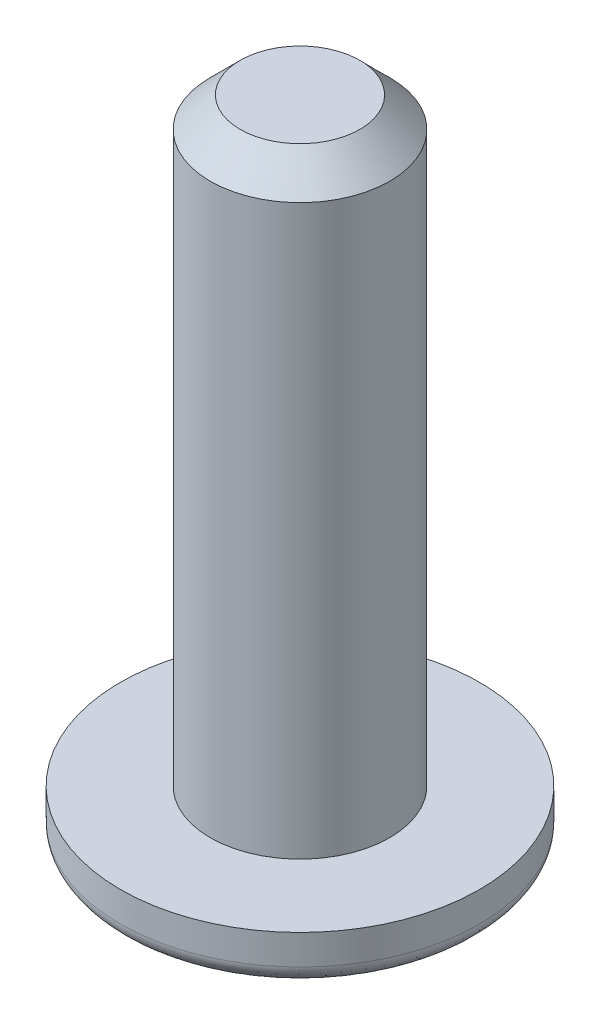
ISO-10303-21;
HEADER;
FILE_DESCRIPTION(('STEP AP214'),'2;1');
FILE_NAME('part.step','',(''),(''),'','','');
FILE_SCHEMA(('AUTOMOTIVE_DESIGN { 1 0 10303 214 1 1 1 1 }'));
ENDSEC;
DATA;
#1=APPLICATION_CONTEXT('core data for automotive mechanical design processes');
#2=APPLICATION_PROTOCOL_DEFINITION('international standard','automotive_design',2000,#1);
#3=PRODUCT_CONTEXT('',#1,'mechanical');
#4=PRODUCT('Part','Part','',(#3));
#5=PRODUCT_RELATED_PRODUCT_CATEGORY('part','',(#4));
#6=PRODUCT_DEFINITION_FORMATION('','',#4);
#7=PRODUCT_DEFINITION_CONTEXT('part definition',#1,'design');
#8=PRODUCT_DEFINITION('design','',#6,#7);
#9=PRODUCT_DEFINITION_SHAPE('','',#8);
#10=(LENGTH_UNIT() NAMED_UNIT(*) SI_UNIT(.MILLI.,.METRE.));
#11=(NAMED_UNIT(*) PLANE_ANGLE_UNIT() SI_UNIT($,.RADIAN.));
#12=(NAMED_UNIT(*) SI_UNIT($,.STERADIAN.) SOLID_ANGLE_UNIT());
#13=UNCERTAINTY_MEASURE_WITH_UNIT(LENGTH_MEASURE(1.E-05),#10,'distance_accuracy_value','');
#14=(GEOMETRIC_REPRESENTATION_CONTEXT(3) GLOBAL_UNCERTAINTY_ASSIGNED_CONTEXT((#13)) GLOBAL_UNIT_ASSIGNED_CONTEXT((#10,
#11,#12)) REPRESENTATION_CONTEXT('',''));
#15=CARTESIAN_POINT('',(0.,0.,0.));
#16=DIRECTION('',(0.,0.,1.));
#17=DIRECTION('',(1.,0.,0.));
#18=AXIS2_PLACEMENT_3D('',#15,#16,#17);
#19=CARTESIAN_POINT('',(0.,1.,0.));
#20=DIRECTION('',(0.,-1.,0.));
#21=DIRECTION('',(0.,0.,-1.));
#22=AXIS2_PLACEMENT_3D('',#19,#20,#21);
#23=CYLINDRICAL_SURFACE('',#22,3.);
#24=CARTESIAN_POINT('',(0.,0.5,3.));
#25=CARTESIAN_POINT('',(-0.39269906533625,0.5,3.));
#26=CARTESIAN_POINT('',(-0.785243668194781,0.5,2.92191802374331));
#27=CARTESIAN_POINT('',(-1.51085692599577,0.5,2.62135917132441));
#28=CARTESIAN_POINT('',(-1.84364017149476,0.5,2.39900051562453));
#29=CARTESIAN_POINT('',(-2.39900051562454,0.5,1.84364017149474));
#30=CARTESIAN_POINT('',(-2.62135917132442,0.5,1.51085692599576));
#31=CARTESIAN_POINT('',(-2.92191802374331,0.5,0.785243668194772));
#32=CARTESIAN_POINT('',(-3.,0.5,0.392699065336268));
#33=CARTESIAN_POINT('',(-3.,0.5,-0.392699065336258));
#34=CARTESIAN_POINT('',(-2.92191802374332,0.5,-0.785243668194757));
#35=CARTESIAN_POINT('',(-2.6213591713244,0.5,-1.51085692599579));
#36=CARTESIAN_POINT('',(-2.39900051562455,0.5,-1.84364017149474));
#37=CARTESIAN_POINT('',(-1.84364017149474,0.5,-2.39900051562454));
#38=CARTESIAN_POINT('',(-1.51085692599579,0.5,-2.6213591713244));
#39=CARTESIAN_POINT('',(-0.785243668194744,0.5,-2.92191802374332));
#40=CARTESIAN_POINT('',(-0.392699065336262,0.5,-3.));
#41=CARTESIAN_POINT('',(0.392699065336263,0.5,-3.));
#42=CARTESIAN_POINT('',(0.785243668194793,0.5,-2.9219180237433));
#43=CARTESIAN_POINT('',(1.51085692599575,0.5,-2.62135917132442));
#44=CARTESIAN_POINT('',(1.84364017149477,0.5,-2.39900051562452));
#45=CARTESIAN_POINT('',(2.39900051562452,0.5,-1.84364017149477));
#46=CARTESIAN_POINT('',(2.62135917132441,0.5,-1.51085692599577));
#47=CARTESIAN_POINT('',(2.92191802374331,0.5,-0.785243668194774));
#48=CARTESIAN_POINT('',(3.,0.5,-0.392699065336263));
#49=CARTESIAN_POINT('',(3.,0.5,0.392699065336263));
#50=CARTESIAN_POINT('',(2.92191802374331,0.5,0.785243668194767));
#51=CARTESIAN_POINT('',(2.62135917132441,0.5,1.51085692599577));
#52=CARTESIAN_POINT('',(2.3990005156245,0.5,1.84364017149479));
#53=CARTESIAN_POINT('',(1.84364017149479,0.5,2.3990005156245));
#54=CARTESIAN_POINT('',(1.51085692599575,0.5,2.62135917132442));
#55=CARTESIAN_POINT('',(0.785243668194789,0.5,2.9219180237433));
#56=CARTESIAN_POINT('',(0.39269906533625,0.5,3.));
#57=CARTESIAN_POINT('',(0.,0.5,3.));
#58=(BOUNDED_CURVE() B_SPLINE_CURVE(3,(#24,#25,#26,#27,#28,#29,#30,#31,#32,#33,#34,#35,#36,#37,
#38,#39,#40,#41,#42,#43,#44,#45,#46,#47,#48,#49,#50,#51,#52,#53,#54,#55,#56,#57),.UNSPECIFIED.,
.T.,.F.) B_SPLINE_CURVE_WITH_KNOTS((4,2,2,2,2,2,2,2,2,2,2,2,2,2,2,2,4),(0.,0.392699081698725,
0.785398163397448,1.17809724509617,1.5707963267949,1.96349540849362,2.35619449019234,
2.74889357189107,3.14159265358979,3.53429173528852,3.92699081698724,4.31968989868597,
4.71238898038469,5.10508806208341,5.49778714378214,5.89048622548086,6.28318530717959),
.UNSPECIFIED.) CURVE() GEOMETRIC_REPRESENTATION_ITEM() RATIONAL_B_SPLINE_CURVE((1.,1.,1.,1.,1.,
1.,1.,1.,1.,1.,1.,1.,1.,1.,1.,1.,1.,1.,1.,1.,1.,1.,1.,1.,1.,1.,1.,1.,1.,1.,1.,1.,1.,1.)) REPRESENTATION_ITEM(''));
#59=CARTESIAN_POINT('',(0.,0.5,3.));
#60=VERTEX_POINT('',#59);
#61=EDGE_CURVE('E173',#60,#60,#58,.F.);
#62=ORIENTED_EDGE('',*,*,#61,.T.);
#63=EDGE_LOOP('',(#62));
#64=FACE_BOUND('',#63,.T.);
#65=CARTESIAN_POINT('',(0.,1.,0.));
#66=DIRECTION('',(0.,1.,0.));
#67=DIRECTION('',(0.,0.,1.));
#68=AXIS2_PLACEMENT_3D('',#65,#66,#67);
#69=CIRCLE('',#68,3.);
#70=CARTESIAN_POINT('',(0.,1.,3.));
#71=VERTEX_POINT('',#70);
#72=EDGE_CURVE('E159',#71,#71,#69,.T.);
#73=ORIENTED_EDGE('',*,*,#72,.F.);
#74=EDGE_LOOP('',(#73));
#75=FACE_BOUND('',#74,.T.);
#76=ADVANCED_FACE('F44',(#64,#75),#23,.T.);
#77=CARTESIAN_POINT('',(0.,1.,0.));
#78=DIRECTION('',(0.,1.,0.));
#79=DIRECTION('',(0.,0.,1.));
#80=AXIS2_PLACEMENT_3D('',#77,#78,#79);
#81=PLANE('',#80);
#82=CARTESIAN_POINT('',(0.,1.,0.));
#83=DIRECTION('',(0.,1.,0.));
#84=DIRECTION('',(0.,0.,1.));
#85=AXIS2_PLACEMENT_3D('',#82,#83,#84);
#86=CIRCLE('',#85,1.5);
#87=CARTESIAN_POINT('',(0.,1.,1.5));
#88=VERTEX_POINT('',#87);
#89=EDGE_CURVE('E169',#88,#88,#86,.T.);
#90=ORIENTED_EDGE('',*,*,#89,.F.);
#91=EDGE_LOOP('',(#90));
#92=FACE_BOUND('',#91,.T.);
#93=ORIENTED_EDGE('',*,*,#72,.T.);
#94=EDGE_LOOP('',(#93));
#95=FACE_BOUND('',#94,.T.);
#96=ADVANCED_FACE('F195',(#92,#95),#81,.T.);
#97=CARTESIAN_POINT('',(0.,0.,0.));
#98=DIRECTION('',(0.,1.,0.));
#99=DIRECTION('',(0.,0.,1.));
#100=AXIS2_PLACEMENT_3D('',#97,#98,#99);
#101=PLANE('',#100);
#102=CARTESIAN_POINT('',(0.,0.,2.));
#103=CARTESIAN_POINT('',(0.261799376890833,0.,2.));
#104=CARTESIAN_POINT('',(0.523495778796524,0.,1.94794534916221));
#105=CARTESIAN_POINT('',(1.00723795066384,0.,1.74757278088294));
#106=CARTESIAN_POINT('',(1.22909344766318,0.,1.59933367708301));
#107=CARTESIAN_POINT('',(1.59933367708301,0.,1.22909344766318));
#108=CARTESIAN_POINT('',(1.74757278088296,0.,1.00723795066385));
#109=CARTESIAN_POINT('',(1.94794534916219,0.,0.523495778796511));
#110=CARTESIAN_POINT('',(2.,0.,0.261799376890842));
#111=CARTESIAN_POINT('',(2.,0.,-0.261799376890842));
#112=CARTESIAN_POINT('',(1.94794534916222,0.,-0.523495778796526));
#113=CARTESIAN_POINT('',(1.74757278088293,0.,-1.00723795066383));
#114=CARTESIAN_POINT('',(1.59933367708298,0.,-1.22909344766321));
#115=CARTESIAN_POINT('',(1.22909344766321,0.,-1.59933367708298));
#116=CARTESIAN_POINT('',(1.00723795066384,0.,-1.74757278088294));
#117=CARTESIAN_POINT('',(0.523495778796522,0.,-1.9479453491622));
#118=CARTESIAN_POINT('',(0.261799376890842,0.,-2.));
#119=CARTESIAN_POINT('',(-0.261799376890842,0.,-2.));
#120=CARTESIAN_POINT('',(-0.523495778796517,0.,-1.94794534916223));
#121=CARTESIAN_POINT('',(-1.00723795066384,0.,-1.74757278088292));
#122=CARTESIAN_POINT('',(-1.22909344766318,0.,-1.59933367708301));
#123=CARTESIAN_POINT('',(-1.59933367708301,0.,-1.22909344766318));
#124=CARTESIAN_POINT('',(-1.74757278088294,0.,-1.00723795066384));
#125=CARTESIAN_POINT('',(-1.94794534916221,0.,-0.52349577879652));
#126=CARTESIAN_POINT('',(-2.,0.,-0.261799376890839));
#127=CARTESIAN_POINT('',(-2.,0.,0.261799376890845));
#128=CARTESIAN_POINT('',(-1.94794534916221,0.,0.523495778796529));
#129=CARTESIAN_POINT('',(-1.74757278088294,0.,1.00723795066382));
#130=CARTESIAN_POINT('',(-1.59933367708304,0.,1.22909344766315));
#131=CARTESIAN_POINT('',(-1.22909344766316,0.,1.59933367708303));
#132=CARTESIAN_POINT('',(-1.00723795066383,0.,1.74757278088294));
#133=CARTESIAN_POINT('',(-0.523495778796534,0.,1.94794534916221));
#134=CARTESIAN_POINT('',(-0.261799376890834,0.,2.));
#135=CARTESIAN_POINT('',(0.,0.,2.));
#136=(BOUNDED_CURVE() B_SPLINE_CURVE(3,(#102,#103,#104,#105,#106,#107,#108,#109,#110,#111,#112,
#113,#114,#115,#116,#117,#118,#119,#120,#121,#122,#123,#124,#125,#126,#127,#128,#129,#130,#131,
#132,#133,#134,#135),.UNSPECIFIED.,.T.,.F.) B_SPLINE_CURVE_WITH_KNOTS((4,2,2,2,2,2,2,2,2,2,2,2,
2,2,2,2,4),(0.,0.392699081698724,0.785398163397448,1.17809724509617,1.5707963267949,
1.96349540849362,2.35619449019234,2.74889357189107,3.14159265358979,3.53429173528852,
3.92699081698724,4.31968989868597,4.71238898038469,5.10508806208341,5.49778714378214,
5.89048622548086,6.28318530717959),
.UNSPECIFIED.) CURVE() GEOMETRIC_REPRESENTATION_ITEM() RATIONAL_B_SPLINE_CURVE((1.,1.,1.,1.,1.,
1.,1.,1.,1.,1.,1.,1.,1.,1.,1.,1.,1.,1.,1.,1.,1.,1.,1.,1.,1.,1.,1.,1.,1.,1.,1.,1.,1.,1.)) REPRESENTATION_ITEM(''));
#137=CARTESIAN_POINT('',(0.,0.,2.));
#138=VERTEX_POINT('',#137);
#139=EDGE_CURVE('E246',#138,#138,#136,.F.);
#140=ORIENTED_EDGE('',*,*,#139,.T.);
#141=EDGE_LOOP('',(#140));
#142=FACE_BOUND('',#141,.T.);
#143=DIRECTION('',(-0.866025403784439,0.,-0.5));
#144=VECTOR('',#143,1.);
#145=CARTESIAN_POINT('',(0.,0.,1.15470053837925));
#146=LINE('',#145,#144);
#147=CARTESIAN_POINT('',(0.,0.,1.15470053837925));
#148=VERTEX_POINT('',#147);
#149=CARTESIAN_POINT('',(-1.,0.,0.577350269189626));
#150=VERTEX_POINT('',#149);
#151=EDGE_CURVE('E140',#148,#150,#146,.T.);
#152=ORIENTED_EDGE('',*,*,#151,.F.);
#153=DIRECTION('',(-0.866025403784439,0.,0.5));
#154=VECTOR('',#153,1.);
#155=CARTESIAN_POINT('',(0.999999999999999,0.,0.577350269189626));
#156=LINE('',#155,#154);
#157=CARTESIAN_POINT('',(0.999999999999999,0.,0.577350269189626));
#158=VERTEX_POINT('',#157);
#159=EDGE_CURVE('E60',#158,#148,#156,.T.);
#160=ORIENTED_EDGE('',*,*,#159,.F.);
#161=DIRECTION('',(0.,0.,1.));
#162=VECTOR('',#161,1.);
#163=CARTESIAN_POINT('',(1.,0.,-0.577350269189626));
#164=LINE('',#163,#162);
#165=CARTESIAN_POINT('',(1.,0.,-0.577350269189626));
#166=VERTEX_POINT('',#165);
#167=EDGE_CURVE('E153',#166,#158,#164,.T.);
#168=ORIENTED_EDGE('',*,*,#167,.F.);
#169=DIRECTION('',(0.866025403784439,0.,0.5));
#170=VECTOR('',#169,1.);
#171=CARTESIAN_POINT('',(0.,0.,-1.15470053837925));
#172=LINE('',#171,#170);
#173=CARTESIAN_POINT('',(0.,0.,-1.15470053837925));
#174=VERTEX_POINT('',#173);
#175=EDGE_CURVE('E150',#174,#166,#172,.T.);
#176=ORIENTED_EDGE('',*,*,#175,.F.);
#177=DIRECTION('',(0.866025403784439,0.,-0.5));
#178=VECTOR('',#177,1.);
#179=CARTESIAN_POINT('',(-1.,0.,-0.577350269189626));
#180=LINE('',#179,#178);
#181=CARTESIAN_POINT('',(-1.,0.,-0.577350269189626));
#182=VERTEX_POINT('',#181);
#183=EDGE_CURVE('E108',#182,#174,#180,.T.);
#184=ORIENTED_EDGE('',*,*,#183,.F.);
#185=DIRECTION('',(0.,0.,-1.));
#186=VECTOR('',#185,1.);
#187=CARTESIAN_POINT('',(-1.,0.,0.577350269189626));
#188=LINE('',#187,#186);
#189=EDGE_CURVE('E144',#150,#182,#188,.T.);
#190=ORIENTED_EDGE('',*,*,#189,.F.);
#191=EDGE_LOOP('',(#152,#160,#168,#176,#184,#190));
#192=FACE_BOUND('',#191,.T.);
#193=ADVANCED_FACE('F196',(#142,#192),#101,.F.);
#194=CARTESIAN_POINT('',(0.,11.,0.));
#195=DIRECTION('',(0.,-1.,0.));
#196=DIRECTION('',(0.,0.,-1.));
#197=AXIS2_PLACEMENT_3D('',#194,#195,#196);
#198=CYLINDRICAL_SURFACE('',#197,1.5);
#199=CARTESIAN_POINT('',(0.,10.5,0.));
#200=DIRECTION('',(0.,1.,0.));
#201=DIRECTION('',(0.,0.,1.));
#202=AXIS2_PLACEMENT_3D('',#199,#200,#201);
#203=CIRCLE('',#202,1.5);
#204=CARTESIAN_POINT('',(0.,10.5,1.5));
#205=VERTEX_POINT('',#204);
#206=EDGE_CURVE('E12',#205,#205,#203,.F.);
#207=ORIENTED_EDGE('',*,*,#206,.T.);
#208=EDGE_LOOP('',(#207));
#209=FACE_BOUND('',#208,.T.);
#210=ORIENTED_EDGE('',*,*,#89,.T.);
#211=EDGE_LOOP('',(#210));
#212=FACE_BOUND('',#211,.T.);
#213=ADVANCED_FACE('F262',(#209,#212),#198,.T.);
#214=CARTESIAN_POINT('',(0.,11.,0.));
#215=DIRECTION('',(0.,1.,0.));
#216=DIRECTION('',(0.,0.,1.));
#217=AXIS2_PLACEMENT_3D('',#214,#215,#216);
#218=PLANE('',#217);
#219=CARTESIAN_POINT('',(0.,11.,0.));
#220=DIRECTION('',(0.,1.,0.));
#221=DIRECTION('',(0.,0.,1.));
#222=AXIS2_PLACEMENT_3D('',#219,#220,#221);
#223=CIRCLE('',#222,0.999999999999999);
#224=CARTESIAN_POINT('',(0.,11.,0.999999999999999));
#225=VERTEX_POINT('',#224);
#226=EDGE_CURVE('E53',#225,#225,#223,.T.);
#227=ORIENTED_EDGE('',*,*,#226,.T.);
#228=EDGE_LOOP('',(#227));
#229=FACE_BOUND('',#228,.T.);
#230=ADVANCED_FACE('F274',(#229),#218,.T.);
#231=CARTESIAN_POINT('',(0.999999999999999,1.,0.577350269189626));
#232=DIRECTION('',(0.5,0.,0.866025403784439));
#233=DIRECTION('',(0.866025403784439,0.,-0.5));
#234=AXIS2_PLACEMENT_3D('',#231,#232,#233);
#235=PLANE('',#234);
#236=ORIENTED_EDGE('',*,*,#159,.T.);
#237=DIRECTION('',(0.,-1.,0.));
#238=VECTOR('',#237,1.);
#239=CARTESIAN_POINT('',(0.,1.,1.15470053837925));
#240=LINE('',#239,#238);
#241=CARTESIAN_POINT('',(0.,1.,1.15470053837925));
#242=VERTEX_POINT('',#241);
#243=EDGE_CURVE('E90',#242,#148,#240,.T.);
#244=ORIENTED_EDGE('',*,*,#243,.F.);
#245=DIRECTION('',(-0.866025403784439,0.,0.5));
#246=VECTOR('',#245,1.);
#247=CARTESIAN_POINT('',(0.999999999999999,1.,0.577350269189626));
#248=LINE('',#247,#246);
#249=CARTESIAN_POINT('',(0.999999999999999,1.,0.577350269189626));
#250=VERTEX_POINT('',#249);
#251=EDGE_CURVE('E156',#250,#242,#248,.T.);
#252=ORIENTED_EDGE('',*,*,#251,.F.);
#253=DIRECTION('',(0.,-1.,0.));
#254=VECTOR('',#253,1.);
#255=CARTESIAN_POINT('',(0.999999999999999,1.,0.577350269189626));
#256=LINE('',#255,#254);
#257=EDGE_CURVE('E68',#250,#158,#256,.T.);
#258=ORIENTED_EDGE('',*,*,#257,.T.);
#259=EDGE_LOOP('',(#236,#244,#252,#258));
#260=FACE_BOUND('',#259,.T.);
#261=ADVANCED_FACE('F271',(#260),#235,.F.);
#262=CARTESIAN_POINT('',(1.,1.,-0.577350269189626));
#263=DIRECTION('',(1.,0.,0.));
#264=DIRECTION('',(0.,0.,-1.));
#265=AXIS2_PLACEMENT_3D('',#262,#263,#264);
#266=PLANE('',#265);
#267=ORIENTED_EDGE('',*,*,#167,.T.);
#268=ORIENTED_EDGE('',*,*,#257,.F.);
#269=DIRECTION('',(0.,0.,1.));
#270=VECTOR('',#269,1.);
#271=CARTESIAN_POINT('',(1.,1.,-0.577350269189626));
#272=LINE('',#271,#270);
#273=CARTESIAN_POINT('',(1.,1.,-0.577350269189626));
#274=VERTEX_POINT('',#273);
#275=EDGE_CURVE('E122',#274,#250,#272,.T.);
#276=ORIENTED_EDGE('',*,*,#275,.F.);
#277=DIRECTION('',(0.,-1.,0.));
#278=VECTOR('',#277,1.);
#279=CARTESIAN_POINT('',(1.,1.,-0.577350269189626));
#280=LINE('',#279,#278);
#281=EDGE_CURVE('E113',#274,#166,#280,.T.);
#282=ORIENTED_EDGE('',*,*,#281,.T.);
#283=EDGE_LOOP('',(#267,#268,#276,#282));
#284=FACE_BOUND('',#283,.T.);
#285=ADVANCED_FACE('F273',(#284),#266,.F.);
#286=CARTESIAN_POINT('',(0.,1.,-1.15470053837925));
#287=DIRECTION('',(0.5,0.,-0.866025403784438));
#288=DIRECTION('',(-0.866025403784439,0.,-0.5));
#289=AXIS2_PLACEMENT_3D('',#286,#287,#288);
#290=PLANE('',#289);
#291=ORIENTED_EDGE('',*,*,#175,.T.);
#292=ORIENTED_EDGE('',*,*,#281,.F.);
#293=DIRECTION('',(0.866025403784439,0.,0.5));
#294=VECTOR('',#293,1.);
#295=CARTESIAN_POINT('',(0.,1.,-1.15470053837925));
#296=LINE('',#295,#294);
#297=CARTESIAN_POINT('',(0.,1.,-1.15470053837925));
#298=VERTEX_POINT('',#297);
#299=EDGE_CURVE('E117',#298,#274,#296,.T.);
#300=ORIENTED_EDGE('',*,*,#299,.F.);
#301=DIRECTION('',(0.,-1.,0.));
#302=VECTOR('',#301,1.);
#303=CARTESIAN_POINT('',(0.,1.,-1.15470053837925));
#304=LINE('',#303,#302);
#305=EDGE_CURVE('E101',#298,#174,#304,.T.);
#306=ORIENTED_EDGE('',*,*,#305,.T.);
#307=EDGE_LOOP('',(#291,#292,#300,#306));
#308=FACE_BOUND('',#307,.T.);
#309=ADVANCED_FACE('F118',(#308),#290,.F.);
#310=CARTESIAN_POINT('',(-1.,1.,-0.577350269189626));
#311=DIRECTION('',(-0.5,0.,-0.866025403784439));
#312=DIRECTION('',(-0.866025403784439,0.,0.5));
#313=AXIS2_PLACEMENT_3D('',#310,#311,#312);
#314=PLANE('',#313);
#315=ORIENTED_EDGE('',*,*,#183,.T.);
#316=ORIENTED_EDGE('',*,*,#305,.F.);
#317=DIRECTION('',(0.866025403784439,0.,-0.5));
#318=VECTOR('',#317,1.);
#319=CARTESIAN_POINT('',(-1.,1.,-0.577350269189626));
#320=LINE('',#319,#318);
#321=CARTESIAN_POINT('',(-1.,1.,-0.577350269189626));
#322=VERTEX_POINT('',#321);
#323=EDGE_CURVE('E105',#322,#298,#320,.T.);
#324=ORIENTED_EDGE('',*,*,#323,.F.);
#325=DIRECTION('',(0.,-1.,0.));
#326=VECTOR('',#325,1.);
#327=CARTESIAN_POINT('',(-1.,1.,-0.577350269189626));
#328=LINE('',#327,#326);
#329=EDGE_CURVE('E114',#322,#182,#328,.T.);
#330=ORIENTED_EDGE('',*,*,#329,.T.);
#331=EDGE_LOOP('',(#315,#316,#324,#330));
#332=FACE_BOUND('',#331,.T.);
#333=ADVANCED_FACE('F103',(#332),#314,.F.);
#334=CARTESIAN_POINT('',(-1.,1.,0.577350269189626));
#335=DIRECTION('',(-1.,0.,0.));
#336=DIRECTION('',(0.,0.,1.));
#337=AXIS2_PLACEMENT_3D('',#334,#335,#336);
#338=PLANE('',#337);
#339=ORIENTED_EDGE('',*,*,#189,.T.);
#340=ORIENTED_EDGE('',*,*,#329,.F.);
#341=DIRECTION('',(0.,0.,-1.));
#342=VECTOR('',#341,1.);
#343=CARTESIAN_POINT('',(-1.,1.,0.577350269189626));
#344=LINE('',#343,#342);
#345=CARTESIAN_POINT('',(-1.,1.,0.577350269189626));
#346=VERTEX_POINT('',#345);
#347=EDGE_CURVE('E128',#346,#322,#344,.T.);
#348=ORIENTED_EDGE('',*,*,#347,.F.);
#349=DIRECTION('',(0.,-1.,0.));
#350=VECTOR('',#349,1.);
#351=CARTESIAN_POINT('',(-1.,1.,0.577350269189626));
#352=LINE('',#351,#350);
#353=EDGE_CURVE('E164',#346,#150,#352,.T.);
#354=ORIENTED_EDGE('',*,*,#353,.T.);
#355=EDGE_LOOP('',(#339,#340,#348,#354));
#356=FACE_BOUND('',#355,.T.);
#357=ADVANCED_FACE('F337',(#356),#338,.F.);
#358=CARTESIAN_POINT('',(0.,1.,1.15470053837925));
#359=DIRECTION('',(-0.5,0.,0.866025403784439));
#360=DIRECTION('',(0.866025403784439,0.,0.5));
#361=AXIS2_PLACEMENT_3D('',#358,#359,#360);
#362=PLANE('',#361);
#363=ORIENTED_EDGE('',*,*,#151,.T.);
#364=ORIENTED_EDGE('',*,*,#353,.F.);
#365=DIRECTION('',(-0.866025403784439,0.,-0.5));
#366=VECTOR('',#365,1.);
#367=CARTESIAN_POINT('',(0.,1.,1.15470053837925));
#368=LINE('',#367,#366);
#369=EDGE_CURVE('E132',#242,#346,#368,.T.);
#370=ORIENTED_EDGE('',*,*,#369,.F.);
#371=ORIENTED_EDGE('',*,*,#243,.T.);
#372=EDGE_LOOP('',(#363,#364,#370,#371));
#373=FACE_BOUND('',#372,.T.);
#374=ADVANCED_FACE('F267',(#373),#362,.F.);
#375=CARTESIAN_POINT('',(0.,1.,0.));
#376=DIRECTION('',(0.,-1.,0.));
#377=DIRECTION('',(0.,0.,-1.));
#378=AXIS2_PLACEMENT_3D('',#375,#376,#377);
#379=PLANE('',#378);
#380=ORIENTED_EDGE('',*,*,#251,.T.);
#381=ORIENTED_EDGE('',*,*,#369,.T.);
#382=ORIENTED_EDGE('',*,*,#347,.T.);
#383=ORIENTED_EDGE('',*,*,#323,.T.);
#384=ORIENTED_EDGE('',*,*,#299,.T.);
#385=ORIENTED_EDGE('',*,*,#275,.T.);
#386=EDGE_LOOP('',(#380,#381,#382,#383,#384,#385));
#387=FACE_BOUND('',#386,.T.);
#388=ADVANCED_FACE('F125',(#387),#379,.T.);
#389=CARTESIAN_POINT('',(0.,0.5,3.));
#390=CARTESIAN_POINT('',(0.39269906533625,0.5,3.));
#391=CARTESIAN_POINT('',(0.785243668194789,0.5,2.9219180237433));
#392=CARTESIAN_POINT('',(1.51085692599575,0.5,2.62135917132442));
#393=CARTESIAN_POINT('',(1.84364017149479,0.5,2.3990005156245));
#394=CARTESIAN_POINT('',(2.3990005156245,0.5,1.84364017149479));
#395=CARTESIAN_POINT('',(2.62135917132441,0.5,1.51085692599577));
#396=CARTESIAN_POINT('',(2.92191802374331,0.5,0.785243668194767));
#397=CARTESIAN_POINT('',(3.,0.5,0.392699065336263));
#398=CARTESIAN_POINT('',(3.,0.5,-0.392699065336263));
#399=CARTESIAN_POINT('',(2.92191802374331,0.5,-0.785243668194774));
#400=CARTESIAN_POINT('',(2.62135917132441,0.5,-1.51085692599577));
#401=CARTESIAN_POINT('',(2.39900051562452,0.5,-1.84364017149477));
#402=CARTESIAN_POINT('',(1.84364017149477,0.5,-2.39900051562452));
#403=CARTESIAN_POINT('',(1.51085692599575,0.5,-2.62135917132442));
#404=CARTESIAN_POINT('',(0.785243668194793,0.5,-2.9219180237433));
#405=CARTESIAN_POINT('',(0.392699065336263,0.5,-3.));
#406=CARTESIAN_POINT('',(-0.392699065336262,0.5,-3.));
#407=CARTESIAN_POINT('',(-0.785243668194744,0.5,-2.92191802374332));
#408=CARTESIAN_POINT('',(-1.51085692599579,0.5,-2.6213591713244));
#409=CARTESIAN_POINT('',(-1.84364017149474,0.5,-2.39900051562454));
#410=CARTESIAN_POINT('',(-2.39900051562455,0.5,-1.84364017149474));
#411=CARTESIAN_POINT('',(-2.6213591713244,0.5,-1.51085692599579));
#412=CARTESIAN_POINT('',(-2.92191802374332,0.5,-0.785243668194757));
#413=CARTESIAN_POINT('',(-3.,0.5,-0.392699065336258));
#414=CARTESIAN_POINT('',(-3.,0.5,0.392699065336268));
#415=CARTESIAN_POINT('',(-2.92191802374331,0.5,0.785243668194772));
#416=CARTESIAN_POINT('',(-2.62135917132442,0.5,1.51085692599576));
#417=CARTESIAN_POINT('',(-2.39900051562454,0.5,1.84364017149474));
#418=CARTESIAN_POINT('',(-1.84364017149476,0.5,2.39900051562453));
#419=CARTESIAN_POINT('',(-1.51085692599577,0.5,2.62135917132441));
#420=CARTESIAN_POINT('',(-0.785243668194781,0.5,2.92191802374331));
#421=CARTESIAN_POINT('',(-0.39269906533625,0.5,3.));
#422=CARTESIAN_POINT('',(0.,0.5,3.));
#423=CARTESIAN_POINT('',(0.,0.,3.));
#424=CARTESIAN_POINT('',(0.39269906533625,0.,3.));
#425=CARTESIAN_POINT('',(0.785243668194822,0.,2.92191802374331));
#426=CARTESIAN_POINT('',(1.51085692599572,0.,2.62135917132441));
#427=CARTESIAN_POINT('',(1.84364017149479,0.,2.3990005156245));
#428=CARTESIAN_POINT('',(2.3990005156245,0.,1.84364017149479));
#429=CARTESIAN_POINT('',(2.62135917132439,0.,1.51085692599578));
#430=CARTESIAN_POINT('',(2.92191802374333,0.,0.785243668194752));
#431=CARTESIAN_POINT('',(3.,0.,0.392699065336263));
#432=CARTESIAN_POINT('',(3.,0.,-0.392699065336263));
#433=CARTESIAN_POINT('',(2.92191802374333,0.,-0.785243668194754));
#434=CARTESIAN_POINT('',(2.62135917132439,0.,-1.51085692599579));
#435=CARTESIAN_POINT('',(2.39900051562449,0.,-1.84364017149474));
#436=CARTESIAN_POINT('',(1.84364017149479,0.,-2.39900051562455));
#437=CARTESIAN_POINT('',(1.51085692599577,0.,-2.62135917132446));
#438=CARTESIAN_POINT('',(0.785243668194776,0.,-2.92191802374326));
#439=CARTESIAN_POINT('',(0.392699065336263,0.,-3.));
#440=CARTESIAN_POINT('',(-0.392699065336262,0.,-3.));
#441=CARTESIAN_POINT('',(-0.785243668194796,0.,-2.92191802374338));
#442=CARTESIAN_POINT('',(-1.51085692599573,0.,-2.62135917132435));
#443=CARTESIAN_POINT('',(-1.84364017149474,0.,-2.39900051562454));
#444=CARTESIAN_POINT('',(-2.39900051562455,0.,-1.84364017149474));
#445=CARTESIAN_POINT('',(-2.62135917132444,0.,-1.51085692599578));
#446=CARTESIAN_POINT('',(-2.92191802374328,0.,-0.785243668194766));
#447=CARTESIAN_POINT('',(-3.,0.,-0.392699065336258));
#448=CARTESIAN_POINT('',(-3.,0.,0.392699065336268));
#449=CARTESIAN_POINT('',(-2.9219180237434,0.,0.785243668194786));
#450=CARTESIAN_POINT('',(-2.62135917132433,0.,1.51085692599574));
#451=CARTESIAN_POINT('',(-2.39900051562451,0.,1.84364017149471));
#452=CARTESIAN_POINT('',(-1.84364017149478,0.,2.39900051562456));
#453=CARTESIAN_POINT('',(-1.51085692599575,0.,2.62135917132444));
#454=CARTESIAN_POINT('',(-0.785243668194794,0.,2.92191802374328));
#455=CARTESIAN_POINT('',(-0.39269906533625,0.,3.));
#456=CARTESIAN_POINT('',(0.,0.,3.));
#457=CARTESIAN_POINT('',(0.,0.,2.));
#458=CARTESIAN_POINT('',(0.261799376890833,0.,2.));
#459=CARTESIAN_POINT('',(0.523495778796524,0.,1.94794534916221));
#460=CARTESIAN_POINT('',(1.00723795066384,0.,1.74757278088294));
#461=CARTESIAN_POINT('',(1.22909344766318,0.,1.59933367708301));
#462=CARTESIAN_POINT('',(1.59933367708301,0.,1.22909344766318));
#463=CARTESIAN_POINT('',(1.74757278088296,0.,1.00723795066385));
#464=CARTESIAN_POINT('',(1.94794534916219,0.,0.523495778796511));
#465=CARTESIAN_POINT('',(2.,0.,0.261799376890842));
#466=CARTESIAN_POINT('',(2.,0.,-0.261799376890842));
#467=CARTESIAN_POINT('',(1.94794534916222,0.,-0.523495778796526));
#468=CARTESIAN_POINT('',(1.74757278088293,0.,-1.00723795066383));
#469=CARTESIAN_POINT('',(1.59933367708298,0.,-1.22909344766321));
#470=CARTESIAN_POINT('',(1.22909344766321,0.,-1.59933367708298));
#471=CARTESIAN_POINT('',(1.00723795066384,0.,-1.74757278088294));
#472=CARTESIAN_POINT('',(0.523495778796522,0.,-1.9479453491622));
#473=CARTESIAN_POINT('',(0.261799376890842,0.,-2.));
#474=CARTESIAN_POINT('',(-0.261799376890842,0.,-2.));
#475=CARTESIAN_POINT('',(-0.523495778796517,0.,-1.94794534916223));
#476=CARTESIAN_POINT('',(-1.00723795066384,0.,-1.74757278088292));
#477=CARTESIAN_POINT('',(-1.22909344766318,0.,-1.59933367708301));
#478=CARTESIAN_POINT('',(-1.59933367708301,0.,-1.22909344766318));
#479=CARTESIAN_POINT('',(-1.74757278088294,0.,-1.00723795066384));
#480=CARTESIAN_POINT('',(-1.94794534916221,0.,-0.52349577879652));
#481=CARTESIAN_POINT('',(-2.,0.,-0.261799376890839));
#482=CARTESIAN_POINT('',(-2.,0.,0.261799376890845));
#483=CARTESIAN_POINT('',(-1.94794534916221,0.,0.523495778796529));
#484=CARTESIAN_POINT('',(-1.74757278088294,0.,1.00723795066382));
#485=CARTESIAN_POINT('',(-1.59933367708304,0.,1.22909344766315));
#486=CARTESIAN_POINT('',(-1.22909344766316,0.,1.59933367708303));
#487=CARTESIAN_POINT('',(-1.00723795066383,0.,1.74757278088294));
#488=CARTESIAN_POINT('',(-0.523495778796534,0.,1.94794534916221));
#489=CARTESIAN_POINT('',(-0.261799376890834,0.,2.));
#490=CARTESIAN_POINT('',(0.,0.,2.));
#491=(BOUNDED_SURFACE() B_SPLINE_SURFACE(2,3,((#389,#390,#391,#392,#393,#394,#395,#396,#397,
#398,#399,#400,#401,#402,#403,#404,#405,#406,#407,#408,#409,#410,#411,#412,#413,#414,#415,#416,
#417,#418,#419,#420,#421,#422),(#423,#424,#425,#426,#427,#428,#429,#430,#431,#432,#433,#434,
#435,#436,#437,#438,#439,#440,#441,#442,#443,#444,#445,#446,#447,#448,#449,#450,#451,#452,#453,
#454,#455,#456),(#457,#458,#459,#460,#461,#462,#463,#464,#465,#466,#467,#468,#469,#470,#471,
#472,#473,#474,#475,#476,#477,#478,#479,#480,#481,#482,#483,#484,#485,#486,#487,#488,#489,
#490)),.UNSPECIFIED.,.F.,.T.,.F.) B_SPLINE_SURFACE_WITH_KNOTS((3,3),(4,2,2,2,2,2,2,2,2,2,2,2,2,
2,2,2,4),(0.,1.),(0.,0.392699081698724,0.785398163397448,1.17809724509617,1.5707963267949,
1.96349540849362,2.35619449019234,2.74889357189107,3.14159265358979,3.53429173528852,
3.92699081698724,4.31968989868597,4.71238898038469,5.10508806208341,5.49778714378214,
5.89048622548086,6.28318530717959),
.UNSPECIFIED.) GEOMETRIC_REPRESENTATION_ITEM() RATIONAL_B_SPLINE_SURFACE(((1.,1.,1.,1.,1.,1.,1.,
1.,1.,1.,1.,1.,1.,1.,1.,1.,1.,1.,1.,1.,1.,1.,1.,1.,1.,1.,1.,1.,1.,1.,1.,1.,1.,1.),
(0.707106781186548,0.707106781186548,0.707106781186548,0.707106781186548,0.707106781186548,
0.707106781186548,0.707106781186548,0.707106781186548,0.707106781186548,0.707106781186548,
0.707106781186547,0.707106781186547,0.707106781186548,0.707106781186548,0.707106781186548,
0.707106781186548,0.707106781186548,0.707106781186548,0.707106781186548,0.707106781186548,
0.707106781186548,0.707106781186548,0.707106781186548,0.707106781186548,0.707106781186548,
0.707106781186548,0.707106781186548,0.707106781186548,0.707106781186548,0.707106781186548,
0.707106781186548,0.707106781186548,0.707106781186548,0.707106781186548),(1.,1.,1.,1.,1.,1.,1.,
1.,1.,1.,1.,1.,1.,1.,1.,1.,1.,1.,1.,1.,1.,1.,1.,1.,1.,1.,1.,1.,1.,1.,1.,1.,1.,1.))) REPRESENTATION_ITEM('') SURFACE());
#492=ORIENTED_EDGE('',*,*,#139,.F.);
#493=EDGE_LOOP('',(#492));
#494=FACE_BOUND('',#493,.T.);
#495=ORIENTED_EDGE('',*,*,#61,.F.);
#496=EDGE_LOOP('',(#495));
#497=FACE_BOUND('',#496,.T.);
#498=ADVANCED_FACE('F200',(#494,#497),#491,.T.);
#499=CARTESIAN_POINT('',(0.,11.,0.));
#500=DIRECTION('',(0.,-1.,0.));
#501=DIRECTION('',(0.,0.,-1.));
#502=AXIS2_PLACEMENT_3D('',#499,#500,#501);
#503=CONICAL_SURFACE('',#502,0.999999999999999,0.785398163397446);
#504=ORIENTED_EDGE('',*,*,#206,.F.);
#505=EDGE_LOOP('',(#504));
#506=FACE_BOUND('',#505,.T.);
#507=ORIENTED_EDGE('',*,*,#226,.F.);
#508=EDGE_LOOP('',(#507));
#509=FACE_BOUND('',#508,.T.);
#510=ADVANCED_FACE('F47',(#506,#509),#503,.T.);
#511=CLOSED_SHELL('',(#76,#96,#193,#213,#230,#261,#285,#309,#333,#357,#374,#388,#498,#510));
#512=MANIFOLD_SOLID_BREP('B2',#511);
#513=ADVANCED_BREP_SHAPE_REPRESENTATION('',(#18,#512),#14);
#514=SHAPE_DEFINITION_REPRESENTATION(#9,#513);
ENDSEC;
END-ISO-10303-21;
